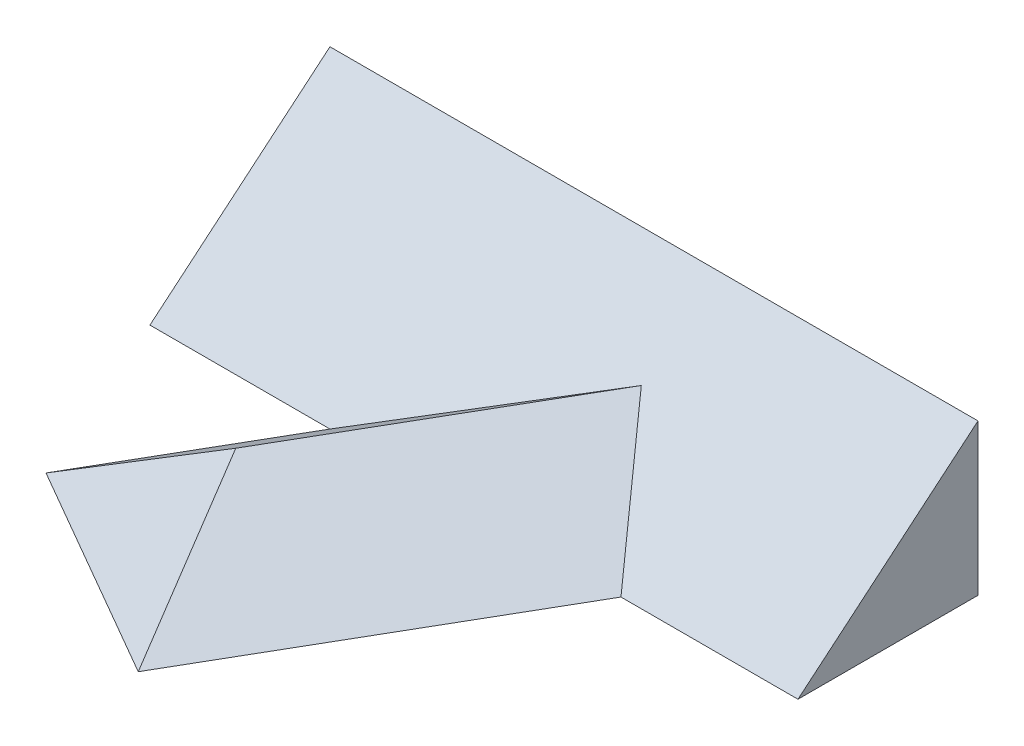
ISO-10303-21;
HEADER;
FILE_DESCRIPTION(('STEP AP214'),'2;1');
FILE_NAME('part.step','',(''),(''),'','','');
FILE_SCHEMA(('AUTOMOTIVE_DESIGN { 1 0 10303 214 1 1 1 1 }'));
ENDSEC;
DATA;
#1=APPLICATION_CONTEXT('core data for automotive mechanical design processes');
#2=APPLICATION_PROTOCOL_DEFINITION('international standard','automotive_design',2000,#1);
#3=PRODUCT_CONTEXT('',#1,'mechanical');
#4=PRODUCT('Part','Part','',(#3));
#5=PRODUCT_RELATED_PRODUCT_CATEGORY('part','',(#4));
#6=PRODUCT_DEFINITION_FORMATION('','',#4);
#7=PRODUCT_DEFINITION_CONTEXT('part definition',#1,'design');
#8=PRODUCT_DEFINITION('design','',#6,#7);
#9=PRODUCT_DEFINITION_SHAPE('','',#8);
#10=(LENGTH_UNIT() NAMED_UNIT(*) SI_UNIT(.MILLI.,.METRE.));
#11=(NAMED_UNIT(*) PLANE_ANGLE_UNIT() SI_UNIT($,.RADIAN.));
#12=(NAMED_UNIT(*) SI_UNIT($,.STERADIAN.) SOLID_ANGLE_UNIT());
#13=UNCERTAINTY_MEASURE_WITH_UNIT(LENGTH_MEASURE(1.E-05),#10,'distance_accuracy_value','');
#14=(GEOMETRIC_REPRESENTATION_CONTEXT(3) GLOBAL_UNCERTAINTY_ASSIGNED_CONTEXT((#13)) GLOBAL_UNIT_ASSIGNED_CONTEXT((#10,
#11,#12)) REPRESENTATION_CONTEXT('',''));
#15=CARTESIAN_POINT('',(0.,0.,0.));
#16=DIRECTION('',(0.,0.,1.));
#17=DIRECTION('',(1.,0.,0.));
#18=AXIS2_PLACEMENT_3D('',#15,#16,#17);
#19=CARTESIAN_POINT('',(180.,41.9549815588635,-50.));
#20=DIRECTION('',(0.,-0.766044443118981,-0.642787609686535));
#21=DIRECTION('',(0.,0.642787609686535,-0.766044443118982));
#22=AXIS2_PLACEMENT_3D('',#19,#20,#21);
#23=PLANE('',#22);
#24=DIRECTION('',(-1.,0.,0.));
#25=VECTOR('',#24,1.);
#26=CARTESIAN_POINT('',(180.,0.,0.));
#27=LINE('',#26,#25);
#28=CARTESIAN_POINT('',(50.,0.,0.));
#29=VERTEX_POINT('',#28);
#30=CARTESIAN_POINT('',(0.,0.,0.));
#31=VERTEX_POINT('',#30);
#32=EDGE_CURVE('E37',#29,#31,#27,.T.);
#33=ORIENTED_EDGE('',*,*,#32,.F.);
#34=DIRECTION('',(0.832439889478472,0.356178486710912,-0.424476991142503));
#35=VECTOR('',#34,1.);
#36=CARTESIAN_POINT('',(170.191414750846,51.4266516569989,-61.2878968673201));
#37=LINE('',#36,#35);
#38=CARTESIAN_POINT('',(107.276968602353,24.5072638373396,-29.2066197228039));
#39=VERTEX_POINT('',#38);
#40=EDGE_CURVE('E106',#29,#39,#37,.T.);
#41=ORIENTED_EDGE('',*,*,#40,.T.);
#42=DIRECTION('',(0.525546623654353,-0.546861072743877,0.651723648092446));
#43=VECTOR('',#42,1.);
#44=CARTESIAN_POINT('',(115.226559385728,16.2352636988127,-19.3484338397746));
#45=LINE('',#44,#43);
#46=CARTESIAN_POINT('',(130.829037686547,0.,0.));
#47=VERTEX_POINT('',#46);
#48=EDGE_CURVE('E104',#39,#47,#45,.T.);
#49=ORIENTED_EDGE('',*,*,#48,.T.);
#50=CARTESIAN_POINT('',(180.,0.,0.));
#51=VERTEX_POINT('',#50);
#52=EDGE_CURVE('E11',#51,#47,#27,.T.);
#53=ORIENTED_EDGE('',*,*,#52,.F.);
#54=DIRECTION('',(0.,-0.642787609686535,0.766044443118982));
#55=VECTOR('',#54,1.);
#56=CARTESIAN_POINT('',(180.,41.9549815588635,-50.));
#57=LINE('',#56,#55);
#58=CARTESIAN_POINT('',(180.,41.9549815588635,-50.));
#59=VERTEX_POINT('',#58);
#60=EDGE_CURVE('E116',#59,#51,#57,.T.);
#61=ORIENTED_EDGE('',*,*,#60,.F.);
#62=DIRECTION('',(-1.,0.,0.));
#63=VECTOR('',#62,1.);
#64=CARTESIAN_POINT('',(180.,41.9549815588635,-50.));
#65=LINE('',#64,#63);
#66=CARTESIAN_POINT('',(0.,41.9549815588635,-50.));
#67=VERTEX_POINT('',#66);
#68=EDGE_CURVE('E121',#59,#67,#65,.T.);
#69=ORIENTED_EDGE('',*,*,#68,.T.);
#70=DIRECTION('',(0.,-0.642787609686535,0.766044443118982));
#71=VECTOR('',#70,1.);
#72=CARTESIAN_POINT('',(0.,41.9549815588635,-50.));
#73=LINE('',#72,#71);
#74=EDGE_CURVE('E109',#67,#31,#73,.T.);
#75=ORIENTED_EDGE('',*,*,#74,.T.);
#76=EDGE_LOOP('',(#33,#41,#49,#53,#61,#69,#75));
#77=FACE_BOUND('',#76,.T.);
#78=ADVANCED_FACE('F30',(#77),#23,.F.);
#79=CARTESIAN_POINT('',(180.,0.,0.));
#80=DIRECTION('',(0.,1.,0.));
#81=DIRECTION('',(0.,0.,1.));
#82=AXIS2_PLACEMENT_3D('',#79,#80,#81);
#83=PLANE('',#82);
#84=ORIENTED_EDGE('',*,*,#52,.T.);
#85=DIRECTION('',(-0.499999999999998,0.,0.86602540378444));
#86=VECTOR('',#85,1.);
#87=CARTESIAN_POINT('',(139.254264805429,0.,-14.5929214352108));
#88=LINE('',#87,#86);
#89=CARTESIAN_POINT('',(81.7542648054297,0.,84.9999999999998));
#90=VERTEX_POINT('',#89);
#91=EDGE_CURVE('E44',#47,#90,#88,.T.);
#92=ORIENTED_EDGE('',*,*,#91,.T.);
#93=DIRECTION('',(0.86602540378444,0.,0.499999999999998));
#94=VECTOR('',#93,1.);
#95=CARTESIAN_POINT('',(81.7542648054297,0.,84.9999999999998));
#96=LINE('',#95,#94);
#97=CARTESIAN_POINT('',(21.1324865405189,0.,50.));
#98=VERTEX_POINT('',#97);
#99=EDGE_CURVE('E83',#98,#90,#96,.T.);
#100=ORIENTED_EDGE('',*,*,#99,.F.);
#101=DIRECTION('',(-0.499999999999998,0.,0.86602540378444));
#102=VECTOR('',#101,1.);
#103=CARTESIAN_POINT('',(78.6324865405186,0.,-49.5929214352106));
#104=LINE('',#103,#102);
#105=EDGE_CURVE('E100',#29,#98,#104,.T.);
#106=ORIENTED_EDGE('',*,*,#105,.F.);
#107=ORIENTED_EDGE('',*,*,#32,.T.);
#108=DIRECTION('',(0.,0.,-1.));
#109=VECTOR('',#108,1.);
#110=CARTESIAN_POINT('',(0.,0.,0.));
#111=LINE('',#110,#109);
#112=CARTESIAN_POINT('',(0.,0.,-50.));
#113=VERTEX_POINT('',#112);
#114=EDGE_CURVE('E112',#31,#113,#111,.T.);
#115=ORIENTED_EDGE('',*,*,#114,.T.);
#116=DIRECTION('',(-1.,0.,0.));
#117=VECTOR('',#116,1.);
#118=CARTESIAN_POINT('',(180.,0.,-50.));
#119=LINE('',#118,#117);
#120=CARTESIAN_POINT('',(180.,0.,-50.));
#121=VERTEX_POINT('',#120);
#122=EDGE_CURVE('E123',#121,#113,#119,.T.);
#123=ORIENTED_EDGE('',*,*,#122,.F.);
#124=DIRECTION('',(0.,0.,-1.));
#125=VECTOR('',#124,1.);
#126=CARTESIAN_POINT('',(180.,0.,0.));
#127=LINE('',#126,#125);
#128=EDGE_CURVE('E118',#51,#121,#127,.T.);
#129=ORIENTED_EDGE('',*,*,#128,.F.);
#130=EDGE_LOOP('',(#84,#92,#100,#106,#107,#115,#123,#129));
#131=FACE_BOUND('',#130,.T.);
#132=ADVANCED_FACE('F97',(#131),#83,.F.);
#133=CARTESIAN_POINT('',(180.,0.,-50.));
#134=DIRECTION('',(0.,0.,1.));
#135=DIRECTION('',(1.,0.,0.));
#136=AXIS2_PLACEMENT_3D('',#133,#134,#135);
#137=PLANE('',#136);
#138=DIRECTION('',(0.,1.,0.));
#139=VECTOR('',#138,1.);
#140=CARTESIAN_POINT('',(0.,0.,-50.));
#141=LINE('',#140,#139);
#142=EDGE_CURVE('E114',#113,#67,#141,.T.);
#143=ORIENTED_EDGE('',*,*,#142,.T.);
#144=ORIENTED_EDGE('',*,*,#68,.F.);
#145=DIRECTION('',(0.,1.,0.));
#146=VECTOR('',#145,1.);
#147=CARTESIAN_POINT('',(180.,0.,-50.));
#148=LINE('',#147,#146);
#149=EDGE_CURVE('E52',#121,#59,#148,.T.);
#150=ORIENTED_EDGE('',*,*,#149,.F.);
#151=ORIENTED_EDGE('',*,*,#122,.T.);
#152=EDGE_LOOP('',(#143,#144,#150,#151));
#153=FACE_BOUND('',#152,.T.);
#154=ADVANCED_FACE('F135',(#153),#137,.F.);
#155=CARTESIAN_POINT('',(180.,41.9549815588635,-50.));
#156=DIRECTION('',(-1.,0.,0.));
#157=DIRECTION('',(0.,0.,1.));
#158=AXIS2_PLACEMENT_3D('',#155,#156,#157);
#159=PLANE('',#158);
#160=ORIENTED_EDGE('',*,*,#60,.T.);
#161=ORIENTED_EDGE('',*,*,#128,.T.);
#162=ORIENTED_EDGE('',*,*,#149,.T.);
#163=EDGE_LOOP('',(#160,#161,#162));
#164=FACE_BOUND('',#163,.T.);
#165=ADVANCED_FACE('F137',(#164),#159,.F.);
#166=CARTESIAN_POINT('',(0.,41.9549815588635,-50.));
#167=DIRECTION('',(-1.,0.,0.));
#168=DIRECTION('',(0.,0.,1.));
#169=AXIS2_PLACEMENT_3D('',#166,#167,#168);
#170=PLANE('',#169);
#171=ORIENTED_EDGE('',*,*,#74,.F.);
#172=ORIENTED_EDGE('',*,*,#142,.F.);
#173=ORIENTED_EDGE('',*,*,#114,.F.);
#174=EDGE_LOOP('',(#171,#172,#173));
#175=FACE_BOUND('',#174,.T.);
#176=ADVANCED_FACE('F133',(#175),#170,.T.);
#177=CARTESIAN_POINT('',(78.6324865405186,0.,-49.5929214352106));
#178=DIRECTION('',(-0.496731764892151,0.819152044288995,-0.286788218175519));
#179=DIRECTION('',(-0.855070113272877,-0.518512392703887,0.));
#180=AXIS2_PLACEMENT_3D('',#177,#178,#179);
#181=PLANE('',#180);
#182=DIRECTION('',(-0.867814859938276,-0.473519915993156,0.150586380619711));
#183=VECTOR('',#182,1.);
#184=CARTESIAN_POINT('',(77.4508002369394,30.7298761538861,40.2274420344073));
#185=LINE('',#184,#183);
#186=CARTESIAN_POINT('',(66.0466855343762,24.5072638373395,42.20632536138));
#187=VERTEX_POINT('',#186);
#188=EDGE_CURVE('E87',#187,#98,#185,.T.);
#189=ORIENTED_EDGE('',*,*,#188,.F.);
#190=DIRECTION('',(-0.499999999999998,0.,0.86602540378444));
#191=VECTOR('',#190,1.);
#192=CARTESIAN_POINT('',(108.943375672974,24.5072638373396,-32.0929214352107));
#193=LINE('',#192,#191);
#194=EDGE_CURVE('E95',#39,#187,#193,.T.);
#195=ORIENTED_EDGE('',*,*,#194,.F.);
#196=ORIENTED_EDGE('',*,*,#40,.F.);
#197=ORIENTED_EDGE('',*,*,#105,.T.);
#198=EDGE_LOOP('',(#189,#195,#196,#197));
#199=FACE_BOUND('',#198,.T.);
#200=ADVANCED_FACE('F160',(#199),#181,.T.);
#201=CARTESIAN_POINT('',(108.943375672974,24.5072638373396,-32.0929214352107));
#202=DIRECTION('',(0.496731764892151,0.819152044288995,0.286788218175519));
#203=DIRECTION('',(-0.855070113272877,0.518512392703887,0.));
#204=AXIS2_PLACEMENT_3D('',#201,#202,#203);
#205=PLANE('',#204);
#206=DIRECTION('',(-0.303495798888521,0.473519915993156,-0.826842904798035));
#207=VECTOR('',#206,1.);
#208=CARTESIAN_POINT('',(51.3529850505137,47.4326547133525,2.17485858390468));
#209=LINE('',#208,#207);
#210=EDGE_CURVE('E85',#90,#187,#209,.T.);
#211=ORIENTED_EDGE('',*,*,#210,.F.);
#212=ORIENTED_EDGE('',*,*,#91,.F.);
#213=ORIENTED_EDGE('',*,*,#48,.F.);
#214=ORIENTED_EDGE('',*,*,#194,.T.);
#215=EDGE_LOOP('',(#211,#212,#213,#214));
#216=FACE_BOUND('',#215,.T.);
#217=ADVANCED_FACE('F93',(#216),#205,.T.);
#218=CARTESIAN_POINT('',(21.1324865405189,0.,50.));
#219=DIRECTION('',(0.321393804843266,-0.766044443118982,-0.556670399226417));
#220=DIRECTION('',(0.,0.587858883152551,-0.808963493304015));
#221=AXIS2_PLACEMENT_3D('',#218,#219,#220);
#222=PLANE('',#221);
#223=ORIENTED_EDGE('',*,*,#188,.T.);
#224=ORIENTED_EDGE('',*,*,#99,.T.);
#225=ORIENTED_EDGE('',*,*,#210,.T.);
#226=EDGE_LOOP('',(#223,#224,#225));
#227=FACE_BOUND('',#226,.T.);
#228=ADVANCED_FACE('F84',(#227),#222,.F.);
#229=CLOSED_SHELL('',(#78,#132,#154,#165,#176,#200,#217,#228));
#230=MANIFOLD_SOLID_BREP('B2',#229);
#231=ADVANCED_BREP_SHAPE_REPRESENTATION('',(#18,#230),#14);
#232=SHAPE_DEFINITION_REPRESENTATION(#9,#231);
ENDSEC;
END-ISO-10303-21;
